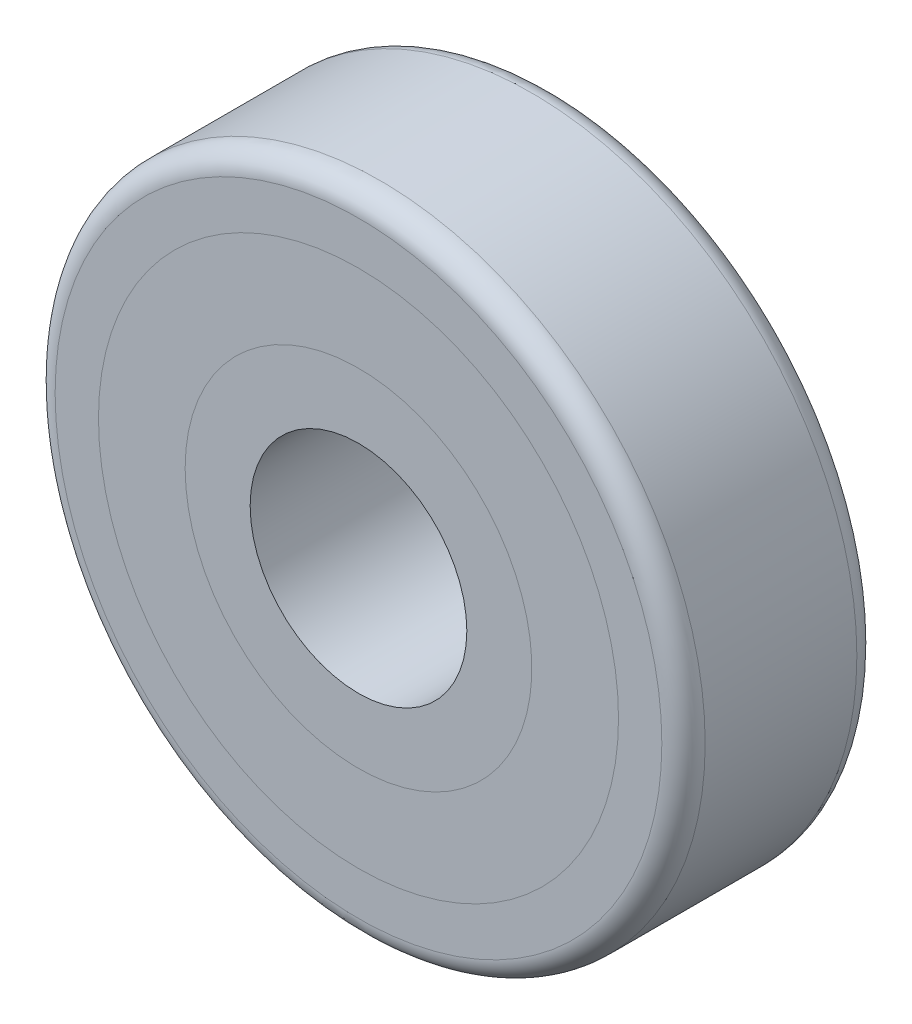
ISO-10303-21;
HEADER;
FILE_DESCRIPTION(('STEP AP214'),'2;1');
FILE_NAME('part.step','',(''),(''),'','','');
FILE_SCHEMA(('AUTOMOTIVE_DESIGN { 1 0 10303 214 1 1 1 1 }'));
ENDSEC;
DATA;
#1=APPLICATION_CONTEXT('core data for automotive mechanical design processes');
#2=APPLICATION_PROTOCOL_DEFINITION('international standard','automotive_design',2000,#1);
#3=PRODUCT_CONTEXT('',#1,'mechanical');
#4=PRODUCT('Part','Part','',(#3));
#5=PRODUCT_RELATED_PRODUCT_CATEGORY('part','',(#4));
#6=PRODUCT_DEFINITION_FORMATION('','',#4);
#7=PRODUCT_DEFINITION_CONTEXT('part definition',#1,'design');
#8=PRODUCT_DEFINITION('design','',#6,#7);
#9=PRODUCT_DEFINITION_SHAPE('','',#8);
#10=(LENGTH_UNIT() NAMED_UNIT(*) SI_UNIT(.MILLI.,.METRE.));
#11=(NAMED_UNIT(*) PLANE_ANGLE_UNIT() SI_UNIT($,.RADIAN.));
#12=(NAMED_UNIT(*) SI_UNIT($,.STERADIAN.) SOLID_ANGLE_UNIT());
#13=UNCERTAINTY_MEASURE_WITH_UNIT(LENGTH_MEASURE(1.E-05),#10,'distance_accuracy_value','');
#14=(GEOMETRIC_REPRESENTATION_CONTEXT(3) GLOBAL_UNCERTAINTY_ASSIGNED_CONTEXT((#13)) GLOBAL_UNIT_ASSIGNED_CONTEXT((#10,
#11,#12)) REPRESENTATION_CONTEXT('',''));
#15=CARTESIAN_POINT('',(0.,0.,0.));
#16=DIRECTION('',(0.,0.,1.));
#17=DIRECTION('',(1.,0.,0.));
#18=AXIS2_PLACEMENT_3D('',#15,#16,#17);
#19=CARTESIAN_POINT('',(0.,0.,9.));
#20=DIRECTION('',(0.,0.,-1.));
#21=DIRECTION('',(-1.,0.,0.));
#22=AXIS2_PLACEMENT_3D('',#19,#20,#21);
#23=CYLINDRICAL_SURFACE('',#22,12.);
#24=CARTESIAN_POINT('',(0.,0.,9.));
#25=DIRECTION('',(0.,0.,-1.));
#26=DIRECTION('',(-1.,0.,0.));
#27=AXIS2_PLACEMENT_3D('',#24,#25,#26);
#28=CIRCLE('',#27,12.);
#29=CARTESIAN_POINT('',(-12.,0.,9.));
#30=VERTEX_POINT('',#29);
#31=EDGE_CURVE('E11',#30,#30,#28,.T.);
#32=ORIENTED_EDGE('',*,*,#31,.T.);
#33=EDGE_LOOP('',(#32));
#34=FACE_BOUND('',#33,.T.);
#35=CARTESIAN_POINT('',(0.,0.,0.));
#36=DIRECTION('',(0.,0.,-1.));
#37=DIRECTION('',(-1.,0.,0.));
#38=AXIS2_PLACEMENT_3D('',#35,#36,#37);
#39=CIRCLE('',#38,12.);
#40=CARTESIAN_POINT('',(-12.,0.,0.));
#41=VERTEX_POINT('',#40);
#42=EDGE_CURVE('E43',#41,#41,#39,.T.);
#43=ORIENTED_EDGE('',*,*,#42,.F.);
#44=EDGE_LOOP('',(#43));
#45=FACE_BOUND('',#44,.T.);
#46=ADVANCED_FACE('F40',(#34,#45),#23,.T.);
#47=CARTESIAN_POINT('',(0.,0.,9.));
#48=DIRECTION('',(0.,0.,-1.));
#49=DIRECTION('',(-1.,0.,0.));
#50=AXIS2_PLACEMENT_3D('',#47,#48,#49);
#51=PLANE('',#50);
#52=CARTESIAN_POINT('',(0.,0.,9.));
#53=DIRECTION('',(0.,0.,-1.));
#54=DIRECTION('',(-1.,0.,0.));
#55=AXIS2_PLACEMENT_3D('',#52,#53,#54);
#56=CIRCLE('',#55,8.);
#57=CARTESIAN_POINT('',(-8.,0.,9.));
#58=VERTEX_POINT('',#57);
#59=EDGE_CURVE('E50',#58,#58,#56,.T.);
#60=ORIENTED_EDGE('',*,*,#59,.T.);
#61=EDGE_LOOP('',(#60));
#62=FACE_BOUND('',#61,.T.);
#63=ORIENTED_EDGE('',*,*,#31,.F.);
#64=EDGE_LOOP('',(#63));
#65=FACE_BOUND('',#64,.T.);
#66=ADVANCED_FACE('F58',(#62,#65),#51,.F.);
#67=CARTESIAN_POINT('',(0.,0.,0.));
#68=DIRECTION('',(0.,0.,-1.));
#69=DIRECTION('',(-1.,0.,0.));
#70=AXIS2_PLACEMENT_3D('',#67,#68,#69);
#71=PLANE('',#70);
#72=CARTESIAN_POINT('',(0.,0.,0.));
#73=DIRECTION('',(0.,0.,-1.));
#74=DIRECTION('',(-1.,0.,0.));
#75=AXIS2_PLACEMENT_3D('',#72,#73,#74);
#76=CIRCLE('',#75,8.);
#77=CARTESIAN_POINT('',(-8.,0.,0.));
#78=VERTEX_POINT('',#77);
#79=EDGE_CURVE('E52',#78,#78,#76,.T.);
#80=ORIENTED_EDGE('',*,*,#79,.F.);
#81=EDGE_LOOP('',(#80));
#82=FACE_BOUND('',#81,.T.);
#83=ORIENTED_EDGE('',*,*,#42,.T.);
#84=EDGE_LOOP('',(#83));
#85=FACE_BOUND('',#84,.T.);
#86=ADVANCED_FACE('F64',(#82,#85),#71,.T.);
#87=CARTESIAN_POINT('',(0.,0.,9.));
#88=DIRECTION('',(0.,0.,-1.));
#89=DIRECTION('',(-1.,0.,0.));
#90=AXIS2_PLACEMENT_3D('',#87,#88,#89);
#91=CYLINDRICAL_SURFACE('',#90,8.);
#92=ORIENTED_EDGE('',*,*,#59,.F.);
#93=EDGE_LOOP('',(#92));
#94=FACE_BOUND('',#93,.T.);
#95=ORIENTED_EDGE('',*,*,#79,.T.);
#96=EDGE_LOOP('',(#95));
#97=FACE_BOUND('',#96,.T.);
#98=ADVANCED_FACE('F61',(#94,#97),#91,.F.);
#99=CLOSED_SHELL('',(#46,#66,#86,#98));
#100=MANIFOLD_SOLID_BREP('B2',#99);
#101=CARTESIAN_POINT('',(0.,0.,9.));
#102=DIRECTION('',(0.,0.,-1.));
#103=DIRECTION('',(-1.,0.,0.));
#104=AXIS2_PLACEMENT_3D('',#101,#102,#103);
#105=CYLINDRICAL_SURFACE('',#104,8.);
#106=CARTESIAN_POINT('',(0.,0.,9.));
#107=DIRECTION('',(0.,0.,-1.));
#108=DIRECTION('',(-1.,0.,0.));
#109=AXIS2_PLACEMENT_3D('',#106,#107,#108);
#110=CIRCLE('',#109,8.);
#111=CARTESIAN_POINT('',(-8.,0.,9.));
#112=VERTEX_POINT('',#111);
#113=EDGE_CURVE('E39',#112,#112,#110,.T.);
#114=ORIENTED_EDGE('',*,*,#113,.T.);
#115=EDGE_LOOP('',(#114));
#116=FACE_BOUND('',#115,.T.);
#117=CARTESIAN_POINT('',(0.,0.,0.));
#118=DIRECTION('',(0.,0.,-1.));
#119=DIRECTION('',(-1.,0.,0.));
#120=AXIS2_PLACEMENT_3D('',#117,#118,#119);
#121=CIRCLE('',#120,8.);
#122=CARTESIAN_POINT('',(-8.,0.,0.));
#123=VERTEX_POINT('',#122);
#124=EDGE_CURVE('E112',#123,#123,#121,.T.);
#125=ORIENTED_EDGE('',*,*,#124,.F.);
#126=EDGE_LOOP('',(#125));
#127=FACE_BOUND('',#126,.T.);
#128=ADVANCED_FACE('F109',(#116,#127),#105,.T.);
#129=CARTESIAN_POINT('',(0.,0.,9.));
#130=DIRECTION('',(0.,0.,-1.));
#131=DIRECTION('',(-1.,0.,0.));
#132=AXIS2_PLACEMENT_3D('',#129,#130,#131);
#133=PLANE('',#132);
#134=CARTESIAN_POINT('',(0.,0.,9.));
#135=DIRECTION('',(0.,0.,-1.));
#136=DIRECTION('',(-1.,0.,0.));
#137=AXIS2_PLACEMENT_3D('',#134,#135,#136);
#138=CIRCLE('',#137,5.);
#139=CARTESIAN_POINT('',(-5.,0.,9.));
#140=VERTEX_POINT('',#139);
#141=EDGE_CURVE('E119',#140,#140,#138,.T.);
#142=ORIENTED_EDGE('',*,*,#141,.T.);
#143=EDGE_LOOP('',(#142));
#144=FACE_BOUND('',#143,.T.);
#145=ORIENTED_EDGE('',*,*,#113,.F.);
#146=EDGE_LOOP('',(#145));
#147=FACE_BOUND('',#146,.T.);
#148=ADVANCED_FACE('F127',(#144,#147),#133,.F.);
#149=CARTESIAN_POINT('',(0.,0.,0.));
#150=DIRECTION('',(0.,0.,-1.));
#151=DIRECTION('',(-1.,0.,0.));
#152=AXIS2_PLACEMENT_3D('',#149,#150,#151);
#153=PLANE('',#152);
#154=CARTESIAN_POINT('',(0.,0.,0.));
#155=DIRECTION('',(0.,0.,-1.));
#156=DIRECTION('',(-1.,0.,0.));
#157=AXIS2_PLACEMENT_3D('',#154,#155,#156);
#158=CIRCLE('',#157,5.);
#159=CARTESIAN_POINT('',(-5.,0.,0.));
#160=VERTEX_POINT('',#159);
#161=EDGE_CURVE('E121',#160,#160,#158,.T.);
#162=ORIENTED_EDGE('',*,*,#161,.F.);
#163=EDGE_LOOP('',(#162));
#164=FACE_BOUND('',#163,.T.);
#165=ORIENTED_EDGE('',*,*,#124,.T.);
#166=EDGE_LOOP('',(#165));
#167=FACE_BOUND('',#166,.T.);
#168=ADVANCED_FACE('F133',(#164,#167),#153,.T.);
#169=CARTESIAN_POINT('',(0.,0.,9.));
#170=DIRECTION('',(0.,0.,-1.));
#171=DIRECTION('',(-1.,0.,0.));
#172=AXIS2_PLACEMENT_3D('',#169,#170,#171);
#173=CYLINDRICAL_SURFACE('',#172,5.);
#174=ORIENTED_EDGE('',*,*,#141,.F.);
#175=EDGE_LOOP('',(#174));
#176=FACE_BOUND('',#175,.T.);
#177=ORIENTED_EDGE('',*,*,#161,.T.);
#178=EDGE_LOOP('',(#177));
#179=FACE_BOUND('',#178,.T.);
#180=ADVANCED_FACE('F130',(#176,#179),#173,.F.);
#181=CLOSED_SHELL('',(#128,#148,#168,#180));
#182=MANIFOLD_SOLID_BREP('B6',#181);
#183=CARTESIAN_POINT('',(0.,0.,9.));
#184=DIRECTION('',(0.,0.,1.));
#185=DIRECTION('',(1.,0.,0.));
#186=AXIS2_PLACEMENT_3D('',#183,#184,#185);
#187=PLANE('',#186);
#188=CARTESIAN_POINT('',(0.,0.,9.));
#189=DIRECTION('',(0.,0.,1.));
#190=DIRECTION('',(1.,0.,0.));
#191=AXIS2_PLACEMENT_3D('',#188,#189,#190);
#192=CIRCLE('',#191,14.);
#193=CARTESIAN_POINT('',(14.,0.,9.));
#194=VERTEX_POINT('',#193);
#195=EDGE_CURVE('E186',#194,#194,#192,.T.);
#196=ORIENTED_EDGE('',*,*,#195,.T.);
#197=EDGE_LOOP('',(#196));
#198=FACE_BOUND('',#197,.T.);
#199=CARTESIAN_POINT('',(0.,0.,9.));
#200=DIRECTION('',(0.,0.,1.));
#201=DIRECTION('',(1.,0.,0.));
#202=AXIS2_PLACEMENT_3D('',#199,#200,#201);
#203=CIRCLE('',#202,12.);
#204=CARTESIAN_POINT('',(12.,0.,9.));
#205=VERTEX_POINT('',#204);
#206=EDGE_CURVE('E191',#205,#205,#203,.T.);
#207=ORIENTED_EDGE('',*,*,#206,.F.);
#208=EDGE_LOOP('',(#207));
#209=FACE_BOUND('',#208,.T.);
#210=ADVANCED_FACE('F171',(#198,#209),#187,.T.);
#211=CARTESIAN_POINT('',(0.,0.,0.));
#212=DIRECTION('',(0.,0.,1.));
#213=DIRECTION('',(1.,0.,0.));
#214=AXIS2_PLACEMENT_3D('',#211,#212,#213);
#215=PLANE('',#214);
#216=CARTESIAN_POINT('',(0.,0.,0.));
#217=DIRECTION('',(0.,0.,1.));
#218=DIRECTION('',(1.,0.,0.));
#219=AXIS2_PLACEMENT_3D('',#216,#217,#218);
#220=CIRCLE('',#219,14.);
#221=CARTESIAN_POINT('',(14.,0.,0.));
#222=VERTEX_POINT('',#221);
#223=EDGE_CURVE('E108',#222,#222,#220,.F.);
#224=ORIENTED_EDGE('',*,*,#223,.T.);
#225=EDGE_LOOP('',(#224));
#226=FACE_BOUND('',#225,.T.);
#227=CARTESIAN_POINT('',(0.,0.,0.));
#228=DIRECTION('',(0.,0.,1.));
#229=DIRECTION('',(1.,0.,0.));
#230=AXIS2_PLACEMENT_3D('',#227,#228,#229);
#231=CIRCLE('',#230,12.);
#232=CARTESIAN_POINT('',(12.,0.,0.));
#233=VERTEX_POINT('',#232);
#234=EDGE_CURVE('E192',#233,#233,#231,.T.);
#235=ORIENTED_EDGE('',*,*,#234,.T.);
#236=EDGE_LOOP('',(#235));
#237=FACE_BOUND('',#236,.T.);
#238=ADVANCED_FACE('F202',(#226,#237),#215,.F.);
#239=CARTESIAN_POINT('',(0.,0.,9.));
#240=DIRECTION('',(0.,0.,-1.));
#241=DIRECTION('',(-1.,0.,0.));
#242=AXIS2_PLACEMENT_3D('',#239,#240,#241);
#243=CYLINDRICAL_SURFACE('',#242,15.);
#244=CARTESIAN_POINT('',(0.,0.,8.));
#245=DIRECTION('',(0.,0.,1.));
#246=DIRECTION('',(1.,0.,0.));
#247=AXIS2_PLACEMENT_3D('',#244,#245,#246);
#248=CIRCLE('',#247,15.);
#249=CARTESIAN_POINT('',(15.,0.,8.));
#250=VERTEX_POINT('',#249);
#251=EDGE_CURVE('E178',#250,#250,#248,.F.);
#252=ORIENTED_EDGE('',*,*,#251,.T.);
#253=EDGE_LOOP('',(#252));
#254=FACE_BOUND('',#253,.T.);
#255=CARTESIAN_POINT('',(0.,0.,0.999999999999999));
#256=DIRECTION('',(0.,0.,1.));
#257=DIRECTION('',(1.,0.,0.));
#258=AXIS2_PLACEMENT_3D('',#255,#256,#257);
#259=CIRCLE('',#258,15.);
#260=CARTESIAN_POINT('',(15.,0.,0.999999999999999));
#261=VERTEX_POINT('',#260);
#262=EDGE_CURVE('E182',#261,#261,#259,.T.);
#263=ORIENTED_EDGE('',*,*,#262,.T.);
#264=EDGE_LOOP('',(#263));
#265=FACE_BOUND('',#264,.T.);
#266=ADVANCED_FACE('F208',(#254,#265),#243,.T.);
#267=CARTESIAN_POINT('',(0.,0.,9.));
#268=DIRECTION('',(0.,0.,-1.));
#269=DIRECTION('',(-1.,0.,0.));
#270=AXIS2_PLACEMENT_3D('',#267,#268,#269);
#271=CYLINDRICAL_SURFACE('',#270,12.);
#272=ORIENTED_EDGE('',*,*,#206,.T.);
#273=EDGE_LOOP('',(#272));
#274=FACE_BOUND('',#273,.T.);
#275=ORIENTED_EDGE('',*,*,#234,.F.);
#276=EDGE_LOOP('',(#275));
#277=FACE_BOUND('',#276,.T.);
#278=ADVANCED_FACE('F198',(#274,#277),#271,.F.);
#279=CARTESIAN_POINT('',(0.,0.,8.));
#280=DIRECTION('',(0.,0.,1.));
#281=DIRECTION('',(1.,0.,0.));
#282=AXIS2_PLACEMENT_3D('',#279,#280,#281);
#283=TOROIDAL_SURFACE('',#282,14.,1.);
#284=ORIENTED_EDGE('',*,*,#251,.F.);
#285=EDGE_LOOP('',(#284));
#286=FACE_BOUND('',#285,.T.);
#287=ORIENTED_EDGE('',*,*,#195,.F.);
#288=EDGE_LOOP('',(#287));
#289=FACE_BOUND('',#288,.T.);
#290=ADVANCED_FACE('F213',(#286,#289),#283,.T.);
#291=CARTESIAN_POINT('',(0.,0.,0.999999999999999));
#292=DIRECTION('',(0.,0.,1.));
#293=DIRECTION('',(1.,0.,0.));
#294=AXIS2_PLACEMENT_3D('',#291,#292,#293);
#295=TOROIDAL_SURFACE('',#294,14.,1.);
#296=ORIENTED_EDGE('',*,*,#223,.F.);
#297=EDGE_LOOP('',(#296));
#298=FACE_BOUND('',#297,.T.);
#299=ORIENTED_EDGE('',*,*,#262,.F.);
#300=EDGE_LOOP('',(#299));
#301=FACE_BOUND('',#300,.T.);
#302=ADVANCED_FACE('F173',(#298,#301),#295,.T.);
#303=CLOSED_SHELL('',(#210,#238,#266,#278,#290,#302));
#304=MANIFOLD_SOLID_BREP('B34',#303);
#305=ADVANCED_BREP_SHAPE_REPRESENTATION('',(#18,#100,#182,#304),#14);
#306=SHAPE_DEFINITION_REPRESENTATION(#9,#305);
ENDSEC;
END-ISO-10303-21;
